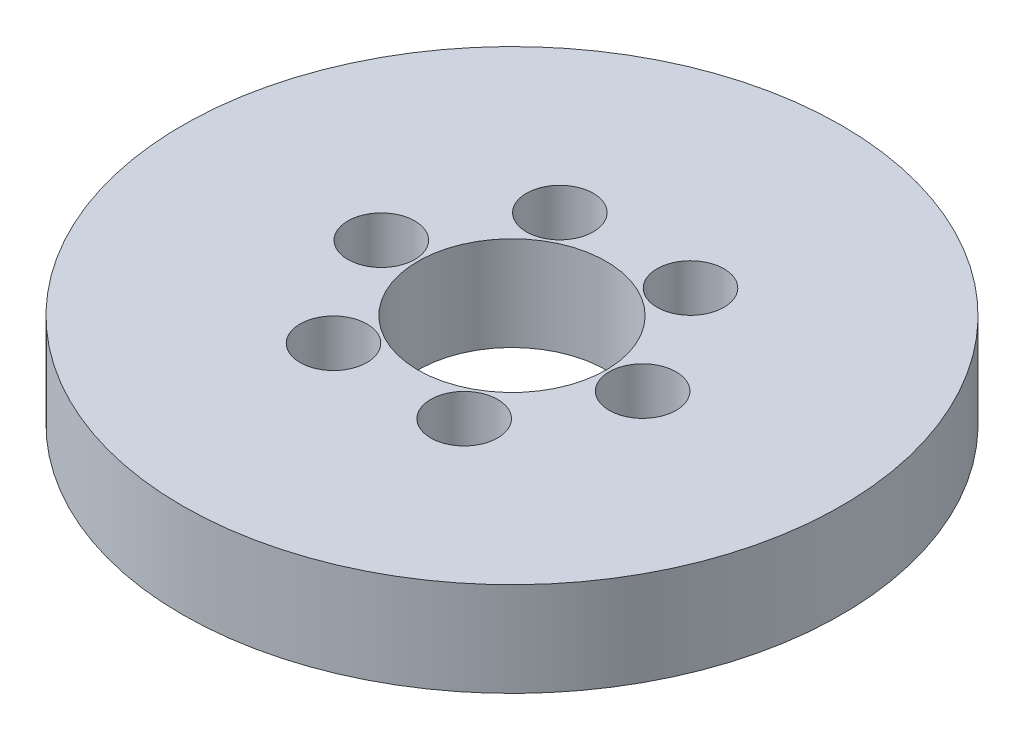
ISO-10303-21;
HEADER;
FILE_DESCRIPTION(('STEP AP214'),'2;1');
FILE_NAME('part.step','',(''),(''),'','','');
FILE_SCHEMA(('AUTOMOTIVE_DESIGN { 1 0 10303 214 1 1 1 1 }'));
ENDSEC;
DATA;
#1=APPLICATION_CONTEXT('core data for automotive mechanical design processes');
#2=APPLICATION_PROTOCOL_DEFINITION('international standard','automotive_design',2000,#1);
#3=PRODUCT_CONTEXT('',#1,'mechanical');
#4=PRODUCT('Part','Part','',(#3));
#5=PRODUCT_RELATED_PRODUCT_CATEGORY('part','',(#4));
#6=PRODUCT_DEFINITION_FORMATION('','',#4);
#7=PRODUCT_DEFINITION_CONTEXT('part definition',#1,'design');
#8=PRODUCT_DEFINITION('design','',#6,#7);
#9=PRODUCT_DEFINITION_SHAPE('','',#8);
#10=(LENGTH_UNIT() NAMED_UNIT(*) SI_UNIT(.MILLI.,.METRE.));
#11=(NAMED_UNIT(*) PLANE_ANGLE_UNIT() SI_UNIT($,.RADIAN.));
#12=(NAMED_UNIT(*) SI_UNIT($,.STERADIAN.) SOLID_ANGLE_UNIT());
#13=UNCERTAINTY_MEASURE_WITH_UNIT(LENGTH_MEASURE(1.E-05),#10,'distance_accuracy_value','');
#14=(GEOMETRIC_REPRESENTATION_CONTEXT(3) GLOBAL_UNCERTAINTY_ASSIGNED_CONTEXT((#13)) GLOBAL_UNIT_ASSIGNED_CONTEXT((#10,
#11,#12)) REPRESENTATION_CONTEXT('',''));
#15=CARTESIAN_POINT('',(0.,0.,0.));
#16=DIRECTION('',(0.,0.,1.));
#17=DIRECTION('',(1.,0.,0.));
#18=AXIS2_PLACEMENT_3D('',#15,#16,#17);
#19=CARTESIAN_POINT('',(0.,20.,0.));
#20=DIRECTION('',(0.,-1.,0.));
#21=DIRECTION('',(0.,0.,-1.));
#22=AXIS2_PLACEMENT_3D('',#19,#20,#21);
#23=CYLINDRICAL_SURFACE('',#22,70.);
#24=CARTESIAN_POINT('',(0.,20.,0.));
#25=DIRECTION('',(0.,1.,0.));
#26=DIRECTION('',(0.,0.,1.));
#27=AXIS2_PLACEMENT_3D('',#24,#25,#26);
#28=CIRCLE('',#27,70.);
#29=CARTESIAN_POINT('',(0.,20.,70.));
#30=VERTEX_POINT('',#29);
#31=EDGE_CURVE('E10',#30,#30,#28,.T.);
#32=ORIENTED_EDGE('',*,*,#31,.F.);
#33=EDGE_LOOP('',(#32));
#34=FACE_BOUND('',#33,.T.);
#35=CARTESIAN_POINT('',(0.,0.,0.));
#36=DIRECTION('',(0.,1.,0.));
#37=DIRECTION('',(0.,0.,1.));
#38=AXIS2_PLACEMENT_3D('',#35,#36,#37);
#39=CIRCLE('',#38,70.);
#40=CARTESIAN_POINT('',(0.,0.,70.));
#41=VERTEX_POINT('',#40);
#42=EDGE_CURVE('E37',#41,#41,#39,.T.);
#43=ORIENTED_EDGE('',*,*,#42,.T.);
#44=EDGE_LOOP('',(#43));
#45=FACE_BOUND('',#44,.T.);
#46=ADVANCED_FACE('F40',(#34,#45),#23,.T.);
#47=CARTESIAN_POINT('',(0.,20.,0.));
#48=DIRECTION('',(0.,1.,0.));
#49=DIRECTION('',(0.,0.,1.));
#50=AXIS2_PLACEMENT_3D('',#47,#48,#49);
#51=PLANE('',#50);
#52=CARTESIAN_POINT('',(-13.8769058974239,20.,-24.0355060661898));
#53=DIRECTION('',(0.,1.,0.));
#54=DIRECTION('',(-0.866025403784433,0.,0.50000000000001));
#55=AXIS2_PLACEMENT_3D('',#52,#53,#54);
#56=CIRCLE('',#55,7.10579785815415);
#57=CARTESIAN_POINT('',(-20.0307073567424,20.,-20.4826071371127));
#58=VERTEX_POINT('',#57);
#59=EDGE_CURVE('E70',#58,#58,#56,.T.);
#60=ORIENTED_EDGE('',*,*,#59,.F.);
#61=EDGE_LOOP('',(#60));
#62=FACE_BOUND('',#61,.T.);
#63=CARTESIAN_POINT('',(13.8769058974234,20.,-24.0355060661901));
#64=DIRECTION('',(0.,1.,0.));
#65=DIRECTION('',(-0.866025403784443,0.,-0.499999999999992));
#66=AXIS2_PLACEMENT_3D('',#63,#64,#65);
#67=CIRCLE('',#66,7.10579785815415);
#68=CARTESIAN_POINT('',(7.72310443810486,20.,-27.5884049952671));
#69=VERTEX_POINT('',#68);
#70=EDGE_CURVE('E71',#69,#69,#67,.T.);
#71=ORIENTED_EDGE('',*,*,#70,.F.);
#72=EDGE_LOOP('',(#71));
#73=FACE_BOUND('',#72,.T.);
#74=CARTESIAN_POINT('',(27.7538117948473,20.,0.));
#75=DIRECTION('',(0.,1.,0.));
#76=DIRECTION('',(0.,0.,-1.));
#77=AXIS2_PLACEMENT_3D('',#74,#75,#76);
#78=CIRCLE('',#77,7.10579785815415);
#79=CARTESIAN_POINT('',(27.7538117948473,20.,-7.10579785815415));
#80=VERTEX_POINT('',#79);
#81=EDGE_CURVE('E78',#80,#80,#78,.T.);
#82=ORIENTED_EDGE('',*,*,#81,.F.);
#83=EDGE_LOOP('',(#82));
#84=FACE_BOUND('',#83,.T.);
#85=CARTESIAN_POINT('',(13.8769058974238,20.,24.0355060661899));
#86=DIRECTION('',(0.,1.,0.));
#87=DIRECTION('',(0.866025403784436,0.,-0.500000000000004));
#88=AXIS2_PLACEMENT_3D('',#85,#86,#87);
#89=CIRCLE('',#88,7.10579785815415);
#90=CARTESIAN_POINT('',(20.0307073567423,20.,20.4826071371128));
#91=VERTEX_POINT('',#90);
#92=EDGE_CURVE('E84',#91,#91,#89,.T.);
#93=ORIENTED_EDGE('',*,*,#92,.F.);
#94=EDGE_LOOP('',(#93));
#95=FACE_BOUND('',#94,.T.);
#96=CARTESIAN_POINT('',(-13.8769058974236,20.,24.03550606619));
#97=DIRECTION('',(0.,1.,0.));
#98=DIRECTION('',(0.86602540378444,0.,0.499999999999998));
#99=AXIS2_PLACEMENT_3D('',#96,#97,#98);
#100=CIRCLE('',#99,7.10579785815415);
#101=CARTESIAN_POINT('',(-7.72310443810505,20.,27.5884049952671));
#102=VERTEX_POINT('',#101);
#103=EDGE_CURVE('E61',#102,#102,#100,.T.);
#104=ORIENTED_EDGE('',*,*,#103,.F.);
#105=EDGE_LOOP('',(#104));
#106=FACE_BOUND('',#105,.T.);
#107=CARTESIAN_POINT('',(-27.7538117948473,20.,0.));
#108=DIRECTION('',(0.,1.,0.));
#109=DIRECTION('',(0.,0.,1.));
#110=AXIS2_PLACEMENT_3D('',#107,#108,#109);
#111=CIRCLE('',#110,7.10579785815415);
#112=CARTESIAN_POINT('',(-27.7538117948473,20.,7.10579785815415));
#113=VERTEX_POINT('',#112);
#114=EDGE_CURVE('E54',#113,#113,#111,.T.);
#115=ORIENTED_EDGE('',*,*,#114,.F.);
#116=EDGE_LOOP('',(#115));
#117=FACE_BOUND('',#116,.T.);
#118=CARTESIAN_POINT('',(0.,20.,0.));
#119=DIRECTION('',(0.,1.,0.));
#120=DIRECTION('',(0.,0.,1.));
#121=AXIS2_PLACEMENT_3D('',#118,#119,#120);
#122=CIRCLE('',#121,20.);
#123=CARTESIAN_POINT('',(0.,20.,20.));
#124=VERTEX_POINT('',#123);
#125=EDGE_CURVE('E50',#124,#124,#122,.T.);
#126=ORIENTED_EDGE('',*,*,#125,.F.);
#127=EDGE_LOOP('',(#126));
#128=FACE_BOUND('',#127,.T.);
#129=ORIENTED_EDGE('',*,*,#31,.T.);
#130=EDGE_LOOP('',(#129));
#131=FACE_BOUND('',#130,.T.);
#132=ADVANCED_FACE('F99',(#62,#73,#84,#95,#106,#117,#128,#131),#51,.T.);
#133=CARTESIAN_POINT('',(0.,0.,0.));
#134=DIRECTION('',(0.,1.,0.));
#135=DIRECTION('',(0.,0.,1.));
#136=AXIS2_PLACEMENT_3D('',#133,#134,#135);
#137=PLANE('',#136);
#138=CARTESIAN_POINT('',(0.,0.,0.));
#139=DIRECTION('',(0.,1.,0.));
#140=DIRECTION('',(0.,0.,1.));
#141=AXIS2_PLACEMENT_3D('',#138,#139,#140);
#142=CIRCLE('',#141,20.);
#143=CARTESIAN_POINT('',(0.,0.,20.));
#144=VERTEX_POINT('',#143);
#145=EDGE_CURVE('E47',#144,#144,#142,.T.);
#146=ORIENTED_EDGE('',*,*,#145,.T.);
#147=EDGE_LOOP('',(#146));
#148=FACE_BOUND('',#147,.T.);
#149=ORIENTED_EDGE('',*,*,#42,.F.);
#150=EDGE_LOOP('',(#149));
#151=FACE_BOUND('',#150,.T.);
#152=ADVANCED_FACE('F103',(#148,#151),#137,.F.);
#153=CARTESIAN_POINT('',(0.,20.,0.));
#154=DIRECTION('',(0.,-1.,0.));
#155=DIRECTION('',(0.,0.,-1.));
#156=AXIS2_PLACEMENT_3D('',#153,#154,#155);
#157=CYLINDRICAL_SURFACE('',#156,20.);
#158=ORIENTED_EDGE('',*,*,#125,.T.);
#159=EDGE_LOOP('',(#158));
#160=FACE_BOUND('',#159,.T.);
#161=ORIENTED_EDGE('',*,*,#145,.F.);
#162=EDGE_LOOP('',(#161));
#163=FACE_BOUND('',#162,.T.);
#164=ADVANCED_FACE('F115',(#160,#163),#157,.F.);
#165=CARTESIAN_POINT('',(-27.7538117948473,7.62769382203381,0.));
#166=DIRECTION('',(0.,1.,0.));
#167=DIRECTION('',(0.,0.,1.));
#168=AXIS2_PLACEMENT_3D('',#165,#166,#167);
#169=CYLINDRICAL_SURFACE('',#168,7.10579785815415);
#170=CARTESIAN_POINT('',(-27.7538117948473,7.62769382203381,0.));
#171=DIRECTION('',(0.,1.,0.));
#172=DIRECTION('',(0.,0.,1.));
#173=AXIS2_PLACEMENT_3D('',#170,#171,#172);
#174=CIRCLE('',#173,7.10579785815415);
#175=CARTESIAN_POINT('',(-27.7538117948473,7.62769382203381,7.10579785815415));
#176=VERTEX_POINT('',#175);
#177=EDGE_CURVE('E55',#176,#176,#174,.T.);
#178=ORIENTED_EDGE('',*,*,#177,.F.);
#179=EDGE_LOOP('',(#178));
#180=FACE_BOUND('',#179,.T.);
#181=ORIENTED_EDGE('',*,*,#114,.T.);
#182=EDGE_LOOP('',(#181));
#183=FACE_BOUND('',#182,.T.);
#184=ADVANCED_FACE('F113',(#180,#183),#169,.F.);
#185=CARTESIAN_POINT('',(-27.7538117948473,7.62769382203381,0.));
#186=DIRECTION('',(0.,1.,0.));
#187=DIRECTION('',(0.,0.,1.));
#188=AXIS2_PLACEMENT_3D('',#185,#186,#187);
#189=PLANE('',#188);
#190=ORIENTED_EDGE('',*,*,#177,.T.);
#191=EDGE_LOOP('',(#190));
#192=FACE_BOUND('',#191,.T.);
#193=ADVANCED_FACE('F144',(#192),#189,.T.);
#194=CARTESIAN_POINT('',(-13.8769058974236,7.62769382203381,24.03550606619));
#195=DIRECTION('',(0.,1.,0.));
#196=DIRECTION('',(0.,0.,1.));
#197=AXIS2_PLACEMENT_3D('',#194,#195,#196);
#198=CYLINDRICAL_SURFACE('',#197,7.10579785815415);
#199=CARTESIAN_POINT('',(-13.8769058974236,7.62769382203381,24.03550606619));
#200=DIRECTION('',(0.,1.,0.));
#201=DIRECTION('',(0.86602540378444,0.,0.499999999999998));
#202=AXIS2_PLACEMENT_3D('',#199,#200,#201);
#203=CIRCLE('',#202,7.10579785815415);
#204=CARTESIAN_POINT('',(-7.72310443810505,7.62769382203381,27.5884049952671));
#205=VERTEX_POINT('',#204);
#206=EDGE_CURVE('E59',#205,#205,#203,.T.);
#207=ORIENTED_EDGE('',*,*,#206,.F.);
#208=EDGE_LOOP('',(#207));
#209=FACE_BOUND('',#208,.T.);
#210=ORIENTED_EDGE('',*,*,#103,.T.);
#211=EDGE_LOOP('',(#210));
#212=FACE_BOUND('',#211,.T.);
#213=ADVANCED_FACE('F153',(#209,#212),#198,.F.);
#214=CARTESIAN_POINT('',(-13.8769058974236,7.62769382203381,24.03550606619));
#215=DIRECTION('',(0.,1.,0.));
#216=DIRECTION('',(0.86602540378444,0.,0.499999999999998));
#217=AXIS2_PLACEMENT_3D('',#214,#215,#216);
#218=PLANE('',#217);
#219=ORIENTED_EDGE('',*,*,#206,.T.);
#220=EDGE_LOOP('',(#219));
#221=FACE_BOUND('',#220,.T.);
#222=ADVANCED_FACE('F96',(#221),#218,.T.);
#223=CARTESIAN_POINT('',(13.8769058974238,7.62769382203381,24.0355060661899));
#224=DIRECTION('',(0.,1.,0.));
#225=DIRECTION('',(0.,0.,1.));
#226=AXIS2_PLACEMENT_3D('',#223,#224,#225);
#227=CYLINDRICAL_SURFACE('',#226,7.10579785815415);
#228=CARTESIAN_POINT('',(13.8769058974238,7.62769382203381,24.0355060661899));
#229=DIRECTION('',(0.,1.,0.));
#230=DIRECTION('',(0.866025403784436,0.,-0.500000000000004));
#231=AXIS2_PLACEMENT_3D('',#228,#229,#230);
#232=CIRCLE('',#231,7.10579785815415);
#233=CARTESIAN_POINT('',(20.0307073567423,7.62769382203381,20.4826071371128));
#234=VERTEX_POINT('',#233);
#235=EDGE_CURVE('E63',#234,#234,#232,.T.);
#236=ORIENTED_EDGE('',*,*,#235,.F.);
#237=EDGE_LOOP('',(#236));
#238=FACE_BOUND('',#237,.T.);
#239=ORIENTED_EDGE('',*,*,#92,.T.);
#240=EDGE_LOOP('',(#239));
#241=FACE_BOUND('',#240,.T.);
#242=ADVANCED_FACE('F91',(#238,#241),#227,.F.);
#243=CARTESIAN_POINT('',(13.8769058974238,7.62769382203381,24.0355060661899));
#244=DIRECTION('',(0.,1.,0.));
#245=DIRECTION('',(0.866025403784436,0.,-0.500000000000004));
#246=AXIS2_PLACEMENT_3D('',#243,#244,#245);
#247=PLANE('',#246);
#248=ORIENTED_EDGE('',*,*,#235,.T.);
#249=EDGE_LOOP('',(#248));
#250=FACE_BOUND('',#249,.T.);
#251=ADVANCED_FACE('F93',(#250),#247,.T.);
#252=CARTESIAN_POINT('',(27.7538117948473,7.62769382203381,0.));
#253=DIRECTION('',(0.,1.,0.));
#254=DIRECTION('',(0.,0.,1.));
#255=AXIS2_PLACEMENT_3D('',#252,#253,#254);
#256=CYLINDRICAL_SURFACE('',#255,7.10579785815415);
#257=CARTESIAN_POINT('',(27.7538117948473,7.62769382203381,0.));
#258=DIRECTION('',(0.,1.,0.));
#259=DIRECTION('',(0.,0.,-1.));
#260=AXIS2_PLACEMENT_3D('',#257,#258,#259);
#261=CIRCLE('',#260,7.10579785815415);
#262=CARTESIAN_POINT('',(27.7538117948473,7.62769382203381,-7.10579785815415));
#263=VERTEX_POINT('',#262);
#264=EDGE_CURVE('E85',#263,#263,#261,.T.);
#265=ORIENTED_EDGE('',*,*,#264,.F.);
#266=EDGE_LOOP('',(#265));
#267=FACE_BOUND('',#266,.T.);
#268=ORIENTED_EDGE('',*,*,#81,.T.);
#269=EDGE_LOOP('',(#268));
#270=FACE_BOUND('',#269,.T.);
#271=ADVANCED_FACE('F187',(#267,#270),#256,.F.);
#272=CARTESIAN_POINT('',(27.7538117948473,7.62769382203381,0.));
#273=DIRECTION('',(0.,1.,0.));
#274=DIRECTION('',(0.,0.,-1.));
#275=AXIS2_PLACEMENT_3D('',#272,#273,#274);
#276=PLANE('',#275);
#277=ORIENTED_EDGE('',*,*,#264,.T.);
#278=EDGE_LOOP('',(#277));
#279=FACE_BOUND('',#278,.T.);
#280=ADVANCED_FACE('F198',(#279),#276,.T.);
#281=CARTESIAN_POINT('',(13.8769058974234,7.62769382203381,-24.0355060661901));
#282=DIRECTION('',(0.,1.,0.));
#283=DIRECTION('',(0.,0.,1.));
#284=AXIS2_PLACEMENT_3D('',#281,#282,#283);
#285=CYLINDRICAL_SURFACE('',#284,7.10579785815415);
#286=CARTESIAN_POINT('',(13.8769058974234,7.62769382203381,-24.0355060661901));
#287=DIRECTION('',(0.,1.,0.));
#288=DIRECTION('',(-0.866025403784443,0.,-0.499999999999992));
#289=AXIS2_PLACEMENT_3D('',#286,#287,#288);
#290=CIRCLE('',#289,7.10579785815415);
#291=CARTESIAN_POINT('',(7.72310443810486,7.62769382203381,-27.5884049952671));
#292=VERTEX_POINT('',#291);
#293=EDGE_CURVE('E76',#292,#292,#290,.T.);
#294=ORIENTED_EDGE('',*,*,#293,.F.);
#295=EDGE_LOOP('',(#294));
#296=FACE_BOUND('',#295,.T.);
#297=ORIENTED_EDGE('',*,*,#70,.T.);
#298=EDGE_LOOP('',(#297));
#299=FACE_BOUND('',#298,.T.);
#300=ADVANCED_FACE('F202',(#296,#299),#285,.F.);
#301=CARTESIAN_POINT('',(13.8769058974234,7.62769382203381,-24.0355060661901));
#302=DIRECTION('',(0.,1.,0.));
#303=DIRECTION('',(-0.866025403784443,0.,-0.499999999999992));
#304=AXIS2_PLACEMENT_3D('',#301,#302,#303);
#305=PLANE('',#304);
#306=ORIENTED_EDGE('',*,*,#293,.T.);
#307=EDGE_LOOP('',(#306));
#308=FACE_BOUND('',#307,.T.);
#309=ADVANCED_FACE('F212',(#308),#305,.T.);
#310=CARTESIAN_POINT('',(-13.8769058974239,7.62769382203381,-24.0355060661898));
#311=DIRECTION('',(0.,1.,0.));
#312=DIRECTION('',(0.,0.,1.));
#313=AXIS2_PLACEMENT_3D('',#310,#311,#312);
#314=CYLINDRICAL_SURFACE('',#313,7.10579785815415);
#315=CARTESIAN_POINT('',(-13.8769058974239,7.62769382203381,-24.0355060661898));
#316=DIRECTION('',(0.,1.,0.));
#317=DIRECTION('',(-0.866025403784433,0.,0.50000000000001));
#318=AXIS2_PLACEMENT_3D('',#315,#316,#317);
#319=CIRCLE('',#318,7.10579785815415);
#320=CARTESIAN_POINT('',(-20.0307073567424,7.62769382203381,-20.4826071371127));
#321=VERTEX_POINT('',#320);
#322=EDGE_CURVE('E69',#321,#321,#319,.T.);
#323=ORIENTED_EDGE('',*,*,#322,.F.);
#324=EDGE_LOOP('',(#323));
#325=FACE_BOUND('',#324,.T.);
#326=ORIENTED_EDGE('',*,*,#59,.T.);
#327=EDGE_LOOP('',(#326));
#328=FACE_BOUND('',#327,.T.);
#329=ADVANCED_FACE('F224',(#325,#328),#314,.F.);
#330=CARTESIAN_POINT('',(-13.8769058974239,7.62769382203381,-24.0355060661898));
#331=DIRECTION('',(0.,1.,0.));
#332=DIRECTION('',(-0.866025403784433,0.,0.50000000000001));
#333=AXIS2_PLACEMENT_3D('',#330,#331,#332);
#334=PLANE('',#333);
#335=ORIENTED_EDGE('',*,*,#322,.T.);
#336=EDGE_LOOP('',(#335));
#337=FACE_BOUND('',#336,.T.);
#338=ADVANCED_FACE('F235',(#337),#334,.T.);
#339=CLOSED_SHELL('',(#46,#132,#152,#164,#184,#193,#213,#222,#242,#251,#271,#280,#300,#309,#329,#338));
#340=MANIFOLD_SOLID_BREP('B2',#339);
#341=ADVANCED_BREP_SHAPE_REPRESENTATION('',(#18,#340),#14);
#342=SHAPE_DEFINITION_REPRESENTATION(#9,#341);
ENDSEC;
END-ISO-10303-21;
